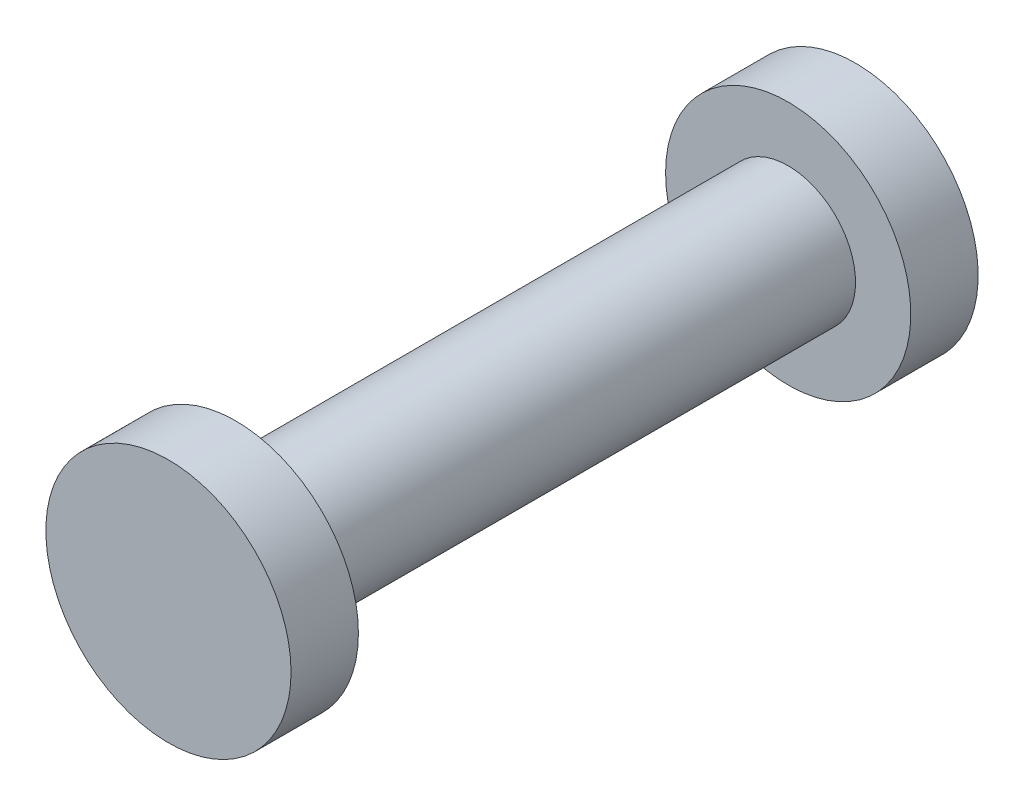
ISO-10303-21;
HEADER;
FILE_DESCRIPTION(('STEP AP214'),'2;1');
FILE_NAME('part.step','',(''),(''),'','','');
FILE_SCHEMA(('AUTOMOTIVE_DESIGN { 1 0 10303 214 1 1 1 1 }'));
ENDSEC;
DATA;
#1=APPLICATION_CONTEXT('core data for automotive mechanical design processes');
#2=APPLICATION_PROTOCOL_DEFINITION('international standard','automotive_design',2000,#1);
#3=PRODUCT_CONTEXT('',#1,'mechanical');
#4=PRODUCT('Part','Part','',(#3));
#5=PRODUCT_RELATED_PRODUCT_CATEGORY('part','',(#4));
#6=PRODUCT_DEFINITION_FORMATION('','',#4);
#7=PRODUCT_DEFINITION_CONTEXT('part definition',#1,'design');
#8=PRODUCT_DEFINITION('design','',#6,#7);
#9=PRODUCT_DEFINITION_SHAPE('','',#8);
#10=(LENGTH_UNIT() NAMED_UNIT(*) SI_UNIT(.MILLI.,.METRE.));
#11=(NAMED_UNIT(*) PLANE_ANGLE_UNIT() SI_UNIT($,.RADIAN.));
#12=(NAMED_UNIT(*) SI_UNIT($,.STERADIAN.) SOLID_ANGLE_UNIT());
#13=UNCERTAINTY_MEASURE_WITH_UNIT(LENGTH_MEASURE(1.E-05),#10,'distance_accuracy_value','');
#14=(GEOMETRIC_REPRESENTATION_CONTEXT(3) GLOBAL_UNCERTAINTY_ASSIGNED_CONTEXT((#13)) GLOBAL_UNIT_ASSIGNED_CONTEXT((#10,
#11,#12)) REPRESENTATION_CONTEXT('',''));
#15=CARTESIAN_POINT('',(0.,0.,0.));
#16=DIRECTION('',(0.,0.,1.));
#17=DIRECTION('',(1.,0.,0.));
#18=AXIS2_PLACEMENT_3D('',#15,#16,#17);
#19=CARTESIAN_POINT('',(0.,0.,5.1));
#20=DIRECTION('',(0.,0.,-1.));
#21=DIRECTION('',(-1.,0.,0.));
#22=AXIS2_PLACEMENT_3D('',#19,#20,#21);
#23=CYLINDRICAL_SURFACE('',#22,0.5);
#24=CARTESIAN_POINT('',(0.,0.,4.6));
#25=DIRECTION('',(0.,0.,1.));
#26=DIRECTION('',(1.,0.,0.));
#27=AXIS2_PLACEMENT_3D('',#24,#25,#26);
#28=CIRCLE('',#27,0.5);
#29=CARTESIAN_POINT('',(0.5,0.,4.6));
#30=VERTEX_POINT('',#29);
#31=EDGE_CURVE('E38',#30,#30,#28,.T.);
#32=ORIENTED_EDGE('',*,*,#31,.F.);
#33=EDGE_LOOP('',(#32));
#34=FACE_BOUND('',#33,.T.);
#35=CARTESIAN_POINT('',(0.,0.,0.5));
#36=DIRECTION('',(0.,0.,-1.));
#37=DIRECTION('',(-1.,0.,0.));
#38=AXIS2_PLACEMENT_3D('',#35,#36,#37);
#39=CIRCLE('',#38,0.5);
#40=CARTESIAN_POINT('',(-0.5,0.,0.5));
#41=VERTEX_POINT('',#40);
#42=EDGE_CURVE('E10',#41,#41,#39,.T.);
#43=ORIENTED_EDGE('',*,*,#42,.F.);
#44=EDGE_LOOP('',(#43));
#45=FACE_BOUND('',#44,.T.);
#46=ADVANCED_FACE('F32',(#34,#45),#23,.T.);
#47=CARTESIAN_POINT('',(0.,0.,4.6));
#48=DIRECTION('',(0.,0.,1.));
#49=DIRECTION('',(1.,0.,0.));
#50=AXIS2_PLACEMENT_3D('',#47,#48,#49);
#51=PLANE('',#50);
#52=CARTESIAN_POINT('',(0.,0.,4.6));
#53=DIRECTION('',(0.,0.,1.));
#54=DIRECTION('',(1.,0.,0.));
#55=AXIS2_PLACEMENT_3D('',#52,#53,#54);
#56=CIRCLE('',#55,0.91);
#57=CARTESIAN_POINT('',(0.91,0.,4.6));
#58=VERTEX_POINT('',#57);
#59=EDGE_CURVE('E42',#58,#58,#56,.T.);
#60=ORIENTED_EDGE('',*,*,#59,.F.);
#61=EDGE_LOOP('',(#60));
#62=FACE_BOUND('',#61,.T.);
#63=ORIENTED_EDGE('',*,*,#31,.T.);
#64=EDGE_LOOP('',(#63));
#65=FACE_BOUND('',#64,.T.);
#66=ADVANCED_FACE('F75',(#62,#65),#51,.F.);
#67=CARTESIAN_POINT('',(0.,0.,4.6));
#68=DIRECTION('',(0.,0.,1.));
#69=DIRECTION('',(1.,0.,0.));
#70=AXIS2_PLACEMENT_3D('',#67,#68,#69);
#71=CYLINDRICAL_SURFACE('',#70,0.91);
#72=ORIENTED_EDGE('',*,*,#59,.T.);
#73=EDGE_LOOP('',(#72));
#74=FACE_BOUND('',#73,.T.);
#75=CARTESIAN_POINT('',(0.,0.,5.1));
#76=DIRECTION('',(0.,0.,1.));
#77=DIRECTION('',(1.,0.,0.));
#78=AXIS2_PLACEMENT_3D('',#75,#76,#77);
#79=CIRCLE('',#78,0.91);
#80=CARTESIAN_POINT('',(0.91,0.,5.1));
#81=VERTEX_POINT('',#80);
#82=EDGE_CURVE('E46',#81,#81,#79,.T.);
#83=ORIENTED_EDGE('',*,*,#82,.F.);
#84=EDGE_LOOP('',(#83));
#85=FACE_BOUND('',#84,.T.);
#86=ADVANCED_FACE('F71',(#74,#85),#71,.T.);
#87=CARTESIAN_POINT('',(0.,0.,5.1));
#88=DIRECTION('',(0.,0.,1.));
#89=DIRECTION('',(1.,0.,0.));
#90=AXIS2_PLACEMENT_3D('',#87,#88,#89);
#91=PLANE('',#90);
#92=ORIENTED_EDGE('',*,*,#82,.T.);
#93=EDGE_LOOP('',(#92));
#94=FACE_BOUND('',#93,.T.);
#95=ADVANCED_FACE('F63',(#94),#91,.T.);
#96=CARTESIAN_POINT('',(0.,0.,0.5));
#97=DIRECTION('',(0.,0.,-1.));
#98=DIRECTION('',(-1.,0.,0.));
#99=AXIS2_PLACEMENT_3D('',#96,#97,#98);
#100=PLANE('',#99);
#101=CARTESIAN_POINT('',(0.,0.,0.5));
#102=DIRECTION('',(0.,0.,-1.));
#103=DIRECTION('',(-1.,0.,0.));
#104=AXIS2_PLACEMENT_3D('',#101,#102,#103);
#105=CIRCLE('',#104,0.91);
#106=CARTESIAN_POINT('',(-0.91,0.,0.5));
#107=VERTEX_POINT('',#106);
#108=EDGE_CURVE('E50',#107,#107,#105,.T.);
#109=ORIENTED_EDGE('',*,*,#108,.F.);
#110=EDGE_LOOP('',(#109));
#111=FACE_BOUND('',#110,.T.);
#112=ORIENTED_EDGE('',*,*,#42,.T.);
#113=EDGE_LOOP('',(#112));
#114=FACE_BOUND('',#113,.T.);
#115=ADVANCED_FACE('F61',(#111,#114),#100,.F.);
#116=CARTESIAN_POINT('',(0.,0.,0.5));
#117=DIRECTION('',(0.,0.,-1.));
#118=DIRECTION('',(-1.,0.,0.));
#119=AXIS2_PLACEMENT_3D('',#116,#117,#118);
#120=CYLINDRICAL_SURFACE('',#119,0.91);
#121=ORIENTED_EDGE('',*,*,#108,.T.);
#122=EDGE_LOOP('',(#121));
#123=FACE_BOUND('',#122,.T.);
#124=CARTESIAN_POINT('',(0.,0.,0.));
#125=DIRECTION('',(0.,0.,-1.));
#126=DIRECTION('',(-1.,0.,0.));
#127=AXIS2_PLACEMENT_3D('',#124,#125,#126);
#128=CIRCLE('',#127,0.91);
#129=CARTESIAN_POINT('',(-0.91,0.,0.));
#130=VERTEX_POINT('',#129);
#131=EDGE_CURVE('E52',#130,#130,#128,.T.);
#132=ORIENTED_EDGE('',*,*,#131,.F.);
#133=EDGE_LOOP('',(#132));
#134=FACE_BOUND('',#133,.T.);
#135=ADVANCED_FACE('F58',(#123,#134),#120,.T.);
#136=CARTESIAN_POINT('',(0.,0.,0.));
#137=DIRECTION('',(0.,0.,1.));
#138=DIRECTION('',(1.,0.,0.));
#139=AXIS2_PLACEMENT_3D('',#136,#137,#138);
#140=PLANE('',#139);
#141=ORIENTED_EDGE('',*,*,#131,.T.);
#142=EDGE_LOOP('',(#141));
#143=FACE_BOUND('',#142,.T.);
#144=ADVANCED_FACE('F69',(#143),#140,.F.);
#145=CLOSED_SHELL('',(#46,#66,#86,#95,#115,#135,#144));
#146=MANIFOLD_SOLID_BREP('B2',#145);
#147=ADVANCED_BREP_SHAPE_REPRESENTATION('',(#18,#146),#14);
#148=SHAPE_DEFINITION_REPRESENTATION(#9,#147);
ENDSEC;
END-ISO-10303-21;
